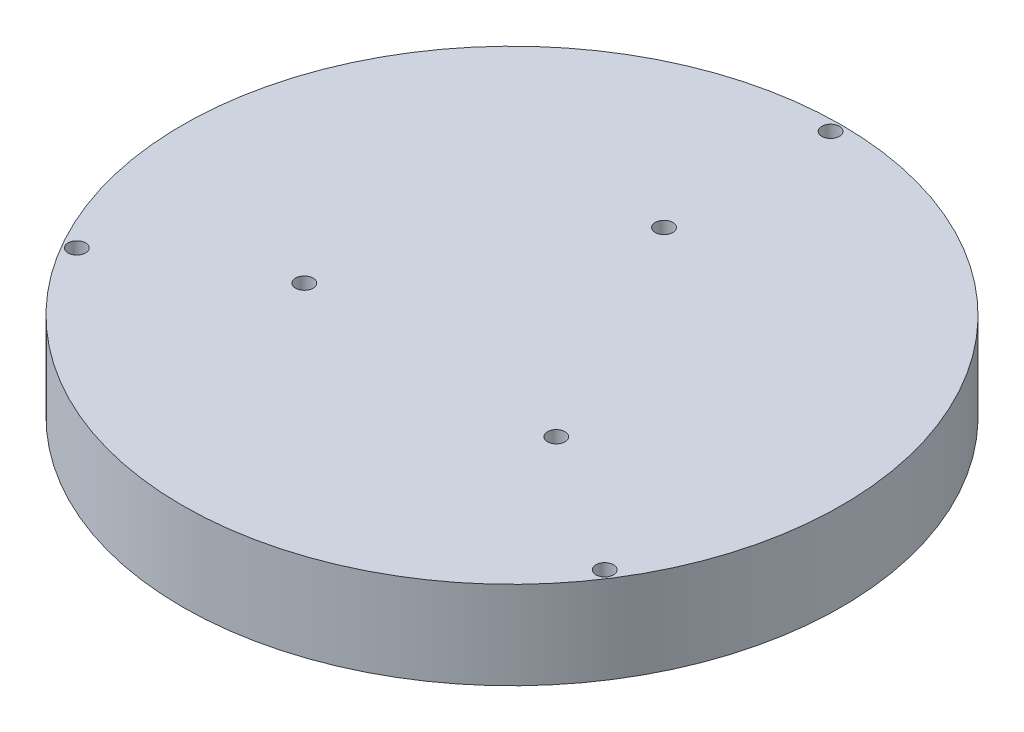
ISO-10303-21;
HEADER;
FILE_DESCRIPTION(('STEP AP214'),'2;1');
FILE_NAME('part.step','',(''),(''),'','','');
FILE_SCHEMA(('AUTOMOTIVE_DESIGN { 1 0 10303 214 1 1 1 1 }'));
ENDSEC;
DATA;
#1=APPLICATION_CONTEXT('core data for automotive mechanical design processes');
#2=APPLICATION_PROTOCOL_DEFINITION('international standard','automotive_design',2000,#1);
#3=PRODUCT_CONTEXT('',#1,'mechanical');
#4=PRODUCT('Part','Part','',(#3));
#5=PRODUCT_RELATED_PRODUCT_CATEGORY('part','',(#4));
#6=PRODUCT_DEFINITION_FORMATION('','',#4);
#7=PRODUCT_DEFINITION_CONTEXT('part definition',#1,'design');
#8=PRODUCT_DEFINITION('design','',#6,#7);
#9=PRODUCT_DEFINITION_SHAPE('','',#8);
#10=(LENGTH_UNIT() NAMED_UNIT(*) SI_UNIT(.MILLI.,.METRE.));
#11=(NAMED_UNIT(*) PLANE_ANGLE_UNIT() SI_UNIT($,.RADIAN.));
#12=(NAMED_UNIT(*) SI_UNIT($,.STERADIAN.) SOLID_ANGLE_UNIT());
#13=UNCERTAINTY_MEASURE_WITH_UNIT(LENGTH_MEASURE(1.E-05),#10,'distance_accuracy_value','');
#14=(GEOMETRIC_REPRESENTATION_CONTEXT(3) GLOBAL_UNCERTAINTY_ASSIGNED_CONTEXT((#13)) GLOBAL_UNIT_ASSIGNED_CONTEXT((#10,
#11,#12)) REPRESENTATION_CONTEXT('',''));
#15=CARTESIAN_POINT('',(0.,0.,0.));
#16=DIRECTION('',(0.,0.,1.));
#17=DIRECTION('',(1.,0.,0.));
#18=AXIS2_PLACEMENT_3D('',#15,#16,#17);
#19=CARTESIAN_POINT('',(0.,10.,0.));
#20=DIRECTION('',(0.,1.,0.));
#21=DIRECTION('',(0.,0.,1.));
#22=AXIS2_PLACEMENT_3D('',#19,#20,#21);
#23=PLANE('',#22);
#24=CARTESIAN_POINT('',(-14.9822394854708,10.,8.65));
#25=DIRECTION('',(0.,1.,0.));
#26=DIRECTION('',(0.,0.,1.));
#27=AXIS2_PLACEMENT_3D('',#24,#25,#26);
#28=CIRCLE('',#27,1.);
#29=CARTESIAN_POINT('',(-14.9822394854708,10.,9.65));
#30=VERTEX_POINT('',#29);
#31=EDGE_CURVE('E80',#30,#30,#28,.T.);
#32=ORIENTED_EDGE('',*,*,#31,.F.);
#33=EDGE_LOOP('',(#32));
#34=FACE_BOUND('',#33,.T.);
#35=CARTESIAN_POINT('',(14.4884497591258,10.,9.45382586984163));
#36=DIRECTION('',(0.,1.,0.));
#37=DIRECTION('',(0.,0.,1.));
#38=AXIS2_PLACEMENT_3D('',#35,#36,#37);
#39=CIRCLE('',#38,1.);
#40=CARTESIAN_POINT('',(14.4884497591258,10.,10.4538258698416));
#41=VERTEX_POINT('',#40);
#42=EDGE_CURVE('E64',#41,#41,#39,.T.);
#43=ORIENTED_EDGE('',*,*,#42,.F.);
#44=EDGE_LOOP('',(#43));
#45=FACE_BOUND('',#44,.T.);
#46=CARTESIAN_POINT('',(0.,10.,-17.3));
#47=DIRECTION('',(0.,1.,0.));
#48=DIRECTION('',(0.,0.,1.));
#49=AXIS2_PLACEMENT_3D('',#46,#47,#48);
#50=CIRCLE('',#49,1.);
#51=CARTESIAN_POINT('',(0.,10.,-16.3));
#52=VERTEX_POINT('',#51);
#53=EDGE_CURVE('E50',#52,#52,#50,.T.);
#54=ORIENTED_EDGE('',*,*,#53,.F.);
#55=EDGE_LOOP('',(#54));
#56=FACE_BOUND('',#55,.T.);
#57=CARTESIAN_POINT('',(0.,10.,0.));
#58=DIRECTION('',(0.,1.,0.));
#59=DIRECTION('',(0.,0.,1.));
#60=AXIS2_PLACEMENT_3D('',#57,#58,#59);
#61=CIRCLE('',#60,37.5);
#62=CARTESIAN_POINT('',(0.,10.,37.5));
#63=VERTEX_POINT('',#62);
#64=EDGE_CURVE('E10',#63,#63,#61,.T.);
#65=ORIENTED_EDGE('',*,*,#64,.T.);
#66=EDGE_LOOP('',(#65));
#67=FACE_BOUND('',#66,.T.);
#68=CARTESIAN_POINT('',(0.,10.,-36.25));
#69=DIRECTION('',(0.,1.,0.));
#70=DIRECTION('',(0.,0.,1.));
#71=AXIS2_PLACEMENT_3D('',#68,#69,#70);
#72=CIRCLE('',#71,1.);
#73=CARTESIAN_POINT('',(0.,10.,-35.25));
#74=VERTEX_POINT('',#73);
#75=EDGE_CURVE('E56',#74,#74,#72,.T.);
#76=ORIENTED_EDGE('',*,*,#75,.F.);
#77=EDGE_LOOP('',(#76));
#78=FACE_BOUND('',#77,.T.);
#79=CARTESIAN_POINT('',(30.3587458825613,10.,19.8093172128184));
#80=DIRECTION('',(0.,1.,0.));
#81=DIRECTION('',(0.,0.,1.));
#82=AXIS2_PLACEMENT_3D('',#79,#80,#81);
#83=CIRCLE('',#82,0.999999999999995);
#84=CARTESIAN_POINT('',(30.3587458825613,10.,20.8093172128184));
#85=VERTEX_POINT('',#84);
#86=EDGE_CURVE('E72',#85,#85,#83,.T.);
#87=ORIENTED_EDGE('',*,*,#86,.F.);
#88=EDGE_LOOP('',(#87));
#89=FACE_BOUND('',#88,.T.);
#90=CARTESIAN_POINT('',(-31.3934208871859,10.,18.125));
#91=DIRECTION('',(0.,1.,0.));
#92=DIRECTION('',(0.,0.,1.));
#93=AXIS2_PLACEMENT_3D('',#90,#91,#92);
#94=CIRCLE('',#93,1.);
#95=CARTESIAN_POINT('',(-31.3934208871859,10.,19.125));
#96=VERTEX_POINT('',#95);
#97=EDGE_CURVE('E88',#96,#96,#94,.T.);
#98=ORIENTED_EDGE('',*,*,#97,.F.);
#99=EDGE_LOOP('',(#98));
#100=FACE_BOUND('',#99,.T.);
#101=ADVANCED_FACE('F37',(#34,#45,#56,#67,#78,#89,#100),#23,.T.);
#102=CARTESIAN_POINT('',(0.,0.,0.));
#103=DIRECTION('',(0.,1.,0.));
#104=DIRECTION('',(0.,0.,1.));
#105=AXIS2_PLACEMENT_3D('',#102,#103,#104);
#106=PLANE('',#105);
#107=CARTESIAN_POINT('',(0.,0.,0.));
#108=DIRECTION('',(0.,1.,0.));
#109=DIRECTION('',(0.,0.,1.));
#110=AXIS2_PLACEMENT_3D('',#107,#108,#109);
#111=CIRCLE('',#110,37.5);
#112=CARTESIAN_POINT('',(0.,0.,37.5));
#113=VERTEX_POINT('',#112);
#114=EDGE_CURVE('E41',#113,#113,#111,.T.);
#115=ORIENTED_EDGE('',*,*,#114,.F.);
#116=EDGE_LOOP('',(#115));
#117=FACE_BOUND('',#116,.T.);
#118=CARTESIAN_POINT('',(0.,0.,-17.3));
#119=DIRECTION('',(0.,1.,0.));
#120=DIRECTION('',(0.,0.,1.));
#121=AXIS2_PLACEMENT_3D('',#118,#119,#120);
#122=CIRCLE('',#121,1.);
#123=CARTESIAN_POINT('',(0.,0.,-16.3));
#124=VERTEX_POINT('',#123);
#125=EDGE_CURVE('E52',#124,#124,#122,.T.);
#126=ORIENTED_EDGE('',*,*,#125,.T.);
#127=EDGE_LOOP('',(#126));
#128=FACE_BOUND('',#127,.T.);
#129=CARTESIAN_POINT('',(0.,0.,-36.25));
#130=DIRECTION('',(0.,1.,0.));
#131=DIRECTION('',(0.,0.,1.));
#132=AXIS2_PLACEMENT_3D('',#129,#130,#131);
#133=CIRCLE('',#132,1.);
#134=CARTESIAN_POINT('',(0.,0.,-35.25));
#135=VERTEX_POINT('',#134);
#136=EDGE_CURVE('E60',#135,#135,#133,.T.);
#137=ORIENTED_EDGE('',*,*,#136,.T.);
#138=EDGE_LOOP('',(#137));
#139=FACE_BOUND('',#138,.T.);
#140=CARTESIAN_POINT('',(14.4884497591258,0.,9.45382586984163));
#141=DIRECTION('',(0.,1.,0.));
#142=DIRECTION('',(0.,0.,1.));
#143=AXIS2_PLACEMENT_3D('',#140,#141,#142);
#144=CIRCLE('',#143,1.);
#145=CARTESIAN_POINT('',(14.4884497591258,0.,10.4538258698416));
#146=VERTEX_POINT('',#145);
#147=EDGE_CURVE('E68',#146,#146,#144,.T.);
#148=ORIENTED_EDGE('',*,*,#147,.T.);
#149=EDGE_LOOP('',(#148));
#150=FACE_BOUND('',#149,.T.);
#151=CARTESIAN_POINT('',(30.3587458825613,0.,19.8093172128184));
#152=DIRECTION('',(0.,1.,0.));
#153=DIRECTION('',(0.,0.,1.));
#154=AXIS2_PLACEMENT_3D('',#151,#152,#153);
#155=CIRCLE('',#154,0.999999999999995);
#156=CARTESIAN_POINT('',(30.3587458825613,0.,20.8093172128184));
#157=VERTEX_POINT('',#156);
#158=EDGE_CURVE('E76',#157,#157,#155,.T.);
#159=ORIENTED_EDGE('',*,*,#158,.T.);
#160=EDGE_LOOP('',(#159));
#161=FACE_BOUND('',#160,.T.);
#162=CARTESIAN_POINT('',(-14.9822394854708,0.,8.65));
#163=DIRECTION('',(0.,1.,0.));
#164=DIRECTION('',(0.,0.,1.));
#165=AXIS2_PLACEMENT_3D('',#162,#163,#164);
#166=CIRCLE('',#165,1.);
#167=CARTESIAN_POINT('',(-14.9822394854708,0.,9.65));
#168=VERTEX_POINT('',#167);
#169=EDGE_CURVE('E84',#168,#168,#166,.T.);
#170=ORIENTED_EDGE('',*,*,#169,.T.);
#171=EDGE_LOOP('',(#170));
#172=FACE_BOUND('',#171,.T.);
#173=CARTESIAN_POINT('',(-31.3934208871859,0.,18.125));
#174=DIRECTION('',(0.,1.,0.));
#175=DIRECTION('',(0.,0.,1.));
#176=AXIS2_PLACEMENT_3D('',#173,#174,#175);
#177=CIRCLE('',#176,1.);
#178=CARTESIAN_POINT('',(-31.3934208871859,0.,19.125));
#179=VERTEX_POINT('',#178);
#180=EDGE_CURVE('E92',#179,#179,#177,.T.);
#181=ORIENTED_EDGE('',*,*,#180,.T.);
#182=EDGE_LOOP('',(#181));
#183=FACE_BOUND('',#182,.T.);
#184=ADVANCED_FACE('F104',(#117,#128,#139,#150,#161,#172,#183),#106,.F.);
#185=CARTESIAN_POINT('',(0.,10.,0.));
#186=DIRECTION('',(0.,-1.,0.));
#187=DIRECTION('',(0.,0.,-1.));
#188=AXIS2_PLACEMENT_3D('',#185,#186,#187);
#189=CYLINDRICAL_SURFACE('',#188,37.5);
#190=ORIENTED_EDGE('',*,*,#64,.F.);
#191=EDGE_LOOP('',(#190));
#192=FACE_BOUND('',#191,.T.);
#193=ORIENTED_EDGE('',*,*,#114,.T.);
#194=EDGE_LOOP('',(#193));
#195=FACE_BOUND('',#194,.T.);
#196=ADVANCED_FACE('F39',(#192,#195),#189,.T.);
#197=CARTESIAN_POINT('',(0.,10.,-17.3));
#198=DIRECTION('',(0.,-1.,0.));
#199=DIRECTION('',(0.,0.,-1.));
#200=AXIS2_PLACEMENT_3D('',#197,#198,#199);
#201=CYLINDRICAL_SURFACE('',#200,1.);
#202=ORIENTED_EDGE('',*,*,#53,.T.);
#203=EDGE_LOOP('',(#202));
#204=FACE_BOUND('',#203,.T.);
#205=ORIENTED_EDGE('',*,*,#125,.F.);
#206=EDGE_LOOP('',(#205));
#207=FACE_BOUND('',#206,.T.);
#208=ADVANCED_FACE('F114',(#204,#207),#201,.F.);
#209=CARTESIAN_POINT('',(0.,10.,-36.25));
#210=DIRECTION('',(0.,-1.,0.));
#211=DIRECTION('',(0.,0.,-1.));
#212=AXIS2_PLACEMENT_3D('',#209,#210,#211);
#213=CYLINDRICAL_SURFACE('',#212,1.);
#214=ORIENTED_EDGE('',*,*,#75,.T.);
#215=EDGE_LOOP('',(#214));
#216=FACE_BOUND('',#215,.T.);
#217=ORIENTED_EDGE('',*,*,#136,.F.);
#218=EDGE_LOOP('',(#217));
#219=FACE_BOUND('',#218,.T.);
#220=ADVANCED_FACE('F117',(#216,#219),#213,.F.);
#221=CARTESIAN_POINT('',(14.4884497591258,10.,9.45382586984163));
#222=DIRECTION('',(0.,-1.,0.));
#223=DIRECTION('',(0.,0.,-1.));
#224=AXIS2_PLACEMENT_3D('',#221,#222,#223);
#225=CYLINDRICAL_SURFACE('',#224,1.);
#226=ORIENTED_EDGE('',*,*,#42,.T.);
#227=EDGE_LOOP('',(#226));
#228=FACE_BOUND('',#227,.T.);
#229=ORIENTED_EDGE('',*,*,#147,.F.);
#230=EDGE_LOOP('',(#229));
#231=FACE_BOUND('',#230,.T.);
#232=ADVANCED_FACE('F121',(#228,#231),#225,.F.);
#233=CARTESIAN_POINT('',(30.3587458825613,10.,19.8093172128184));
#234=DIRECTION('',(0.,-1.,0.));
#235=DIRECTION('',(0.,0.,-1.));
#236=AXIS2_PLACEMENT_3D('',#233,#234,#235);
#237=CYLINDRICAL_SURFACE('',#236,0.999999999999995);
#238=ORIENTED_EDGE('',*,*,#86,.T.);
#239=EDGE_LOOP('',(#238));
#240=FACE_BOUND('',#239,.T.);
#241=ORIENTED_EDGE('',*,*,#158,.F.);
#242=EDGE_LOOP('',(#241));
#243=FACE_BOUND('',#242,.T.);
#244=ADVANCED_FACE('F125',(#240,#243),#237,.F.);
#245=CARTESIAN_POINT('',(-14.9822394854708,10.,8.65));
#246=DIRECTION('',(0.,-1.,0.));
#247=DIRECTION('',(0.,0.,-1.));
#248=AXIS2_PLACEMENT_3D('',#245,#246,#247);
#249=CYLINDRICAL_SURFACE('',#248,1.);
#250=ORIENTED_EDGE('',*,*,#31,.T.);
#251=EDGE_LOOP('',(#250));
#252=FACE_BOUND('',#251,.T.);
#253=ORIENTED_EDGE('',*,*,#169,.F.);
#254=EDGE_LOOP('',(#253));
#255=FACE_BOUND('',#254,.T.);
#256=ADVANCED_FACE('F129',(#252,#255),#249,.F.);
#257=CARTESIAN_POINT('',(-31.3934208871859,10.,18.125));
#258=DIRECTION('',(0.,-1.,0.));
#259=DIRECTION('',(0.,0.,-1.));
#260=AXIS2_PLACEMENT_3D('',#257,#258,#259);
#261=CYLINDRICAL_SURFACE('',#260,1.);
#262=ORIENTED_EDGE('',*,*,#97,.T.);
#263=EDGE_LOOP('',(#262));
#264=FACE_BOUND('',#263,.T.);
#265=ORIENTED_EDGE('',*,*,#180,.F.);
#266=EDGE_LOOP('',(#265));
#267=FACE_BOUND('',#266,.T.);
#268=ADVANCED_FACE('F100',(#264,#267),#261,.F.);
#269=CLOSED_SHELL('',(#101,#184,#196,#208,#220,#232,#244,#256,#268));
#270=MANIFOLD_SOLID_BREP('B2',#269);
#271=ADVANCED_BREP_SHAPE_REPRESENTATION('',(#18,#270),#14);
#272=SHAPE_DEFINITION_REPRESENTATION(#9,#271);
ENDSEC;
END-ISO-10303-21;
